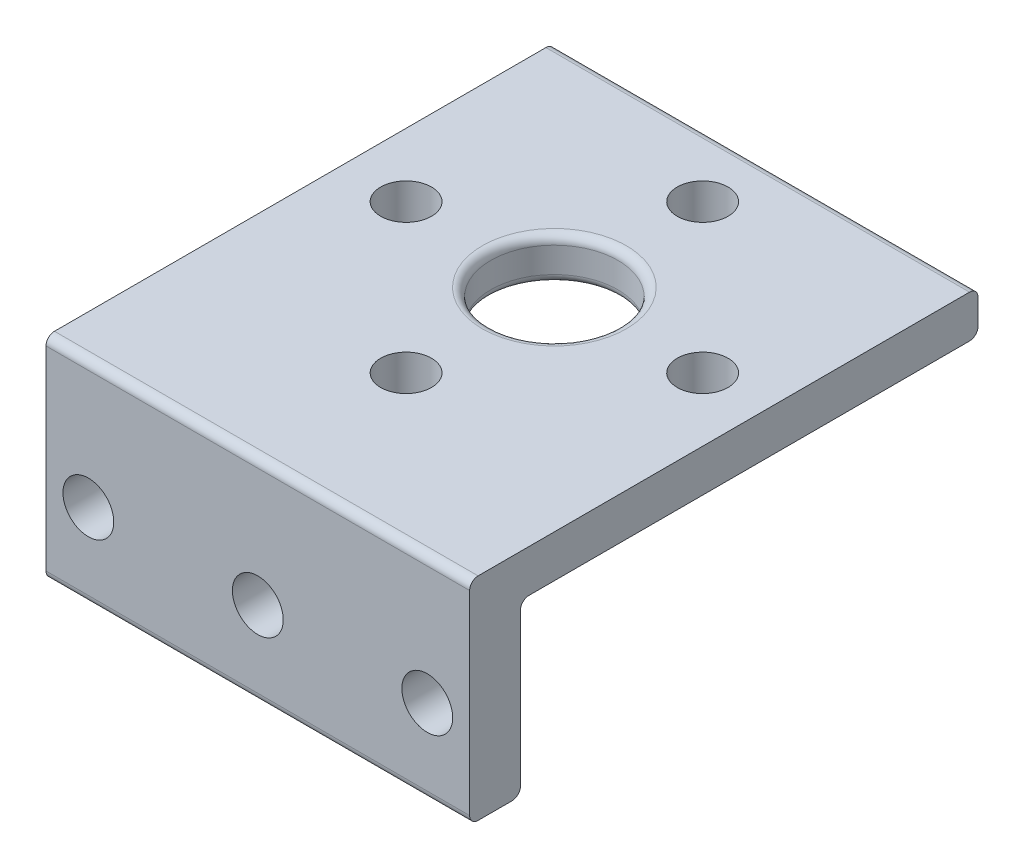
ISO-10303-21;
HEADER;
FILE_DESCRIPTION(('STEP AP214'),'2;1');
FILE_NAME('part.step','',(''),(''),'','','');
FILE_SCHEMA(('AUTOMOTIVE_DESIGN { 1 0 10303 214 1 1 1 1 }'));
ENDSEC;
DATA;
#1=APPLICATION_CONTEXT('core data for automotive mechanical design processes');
#2=APPLICATION_PROTOCOL_DEFINITION('international standard','automotive_design',2000,#1);
#3=PRODUCT_CONTEXT('',#1,'mechanical');
#4=PRODUCT('Part','Part','',(#3));
#5=PRODUCT_RELATED_PRODUCT_CATEGORY('part','',(#4));
#6=PRODUCT_DEFINITION_FORMATION('','',#4);
#7=PRODUCT_DEFINITION_CONTEXT('part definition',#1,'design');
#8=PRODUCT_DEFINITION('design','',#6,#7);
#9=PRODUCT_DEFINITION_SHAPE('','',#8);
#10=(LENGTH_UNIT() NAMED_UNIT(*) SI_UNIT(.MILLI.,.METRE.));
#11=(NAMED_UNIT(*) PLANE_ANGLE_UNIT() SI_UNIT($,.RADIAN.));
#12=(NAMED_UNIT(*) SI_UNIT($,.STERADIAN.) SOLID_ANGLE_UNIT());
#13=UNCERTAINTY_MEASURE_WITH_UNIT(LENGTH_MEASURE(1.E-05),#10,'distance_accuracy_value','');
#14=(GEOMETRIC_REPRESENTATION_CONTEXT(3) GLOBAL_UNCERTAINTY_ASSIGNED_CONTEXT((#13)) GLOBAL_UNIT_ASSIGNED_CONTEXT((#10,
#11,#12)) REPRESENTATION_CONTEXT('',''));
#15=CARTESIAN_POINT('',(0.,0.,0.));
#16=DIRECTION('',(0.,0.,1.));
#17=DIRECTION('',(1.,0.,0.));
#18=AXIS2_PLACEMENT_3D('',#15,#16,#17);
#19=CARTESIAN_POINT('',(0.,0.,0.));
#20=DIRECTION('',(0.,1.,0.));
#21=DIRECTION('',(0.,0.,1.));
#22=AXIS2_PLACEMENT_3D('',#19,#20,#21);
#23=PLANE('',#22);
#24=CARTESIAN_POINT('',(0.,0.,0.));
#25=DIRECTION('',(0.,1.,0.));
#26=DIRECTION('',(0.,0.,1.));
#27=AXIS2_PLACEMENT_3D('',#24,#25,#26);
#28=CIRCLE('',#27,8.5);
#29=CARTESIAN_POINT('',(0.,0.,8.5));
#30=VERTEX_POINT('',#29);
#31=EDGE_CURVE('E175',#30,#30,#28,.T.);
#32=ORIENTED_EDGE('',*,*,#31,.T.);
#33=EDGE_LOOP('',(#32));
#34=FACE_BOUND('',#33,.T.);
#35=CARTESIAN_POINT('',(-17.4999999999996,0.,3.95796859587284E-13));
#36=DIRECTION('',(0.,1.,0.));
#37=DIRECTION('',(0.,0.,1.));
#38=AXIS2_PLACEMENT_3D('',#35,#36,#37);
#39=CIRCLE('',#38,2.99999999999999);
#40=CARTESIAN_POINT('',(-17.4999999999996,0.,3.00000000000039));
#41=VERTEX_POINT('',#40);
#42=EDGE_CURVE('E241',#41,#41,#39,.T.);
#43=ORIENTED_EDGE('',*,*,#42,.T.);
#44=EDGE_LOOP('',(#43));
#45=FACE_BOUND('',#44,.T.);
#46=CARTESIAN_POINT('',(7.87307455377552E-13,0.,17.5));
#47=DIRECTION('',(0.,1.,0.));
#48=DIRECTION('',(0.,0.,1.));
#49=AXIS2_PLACEMENT_3D('',#46,#47,#48);
#50=CIRCLE('',#49,3.);
#51=CARTESIAN_POINT('',(7.87307455377552E-13,0.,20.5));
#52=VERTEX_POINT('',#51);
#53=EDGE_CURVE('E245',#52,#52,#50,.T.);
#54=ORIENTED_EDGE('',*,*,#53,.T.);
#55=EDGE_LOOP('',(#54));
#56=FACE_BOUND('',#55,.T.);
#57=CARTESIAN_POINT('',(17.5000000000004,0.,-3.93653727688776E-13));
#58=DIRECTION('',(0.,1.,0.));
#59=DIRECTION('',(0.,0.,1.));
#60=AXIS2_PLACEMENT_3D('',#57,#58,#59);
#61=CIRCLE('',#60,2.99999999999999);
#62=CARTESIAN_POINT('',(17.5000000000004,0.,2.9999999999996));
#63=VERTEX_POINT('',#62);
#64=EDGE_CURVE('E251',#63,#63,#61,.T.);
#65=ORIENTED_EDGE('',*,*,#64,.T.);
#66=EDGE_LOOP('',(#65));
#67=FACE_BOUND('',#66,.T.);
#68=CARTESIAN_POINT('',(0.,0.,-17.5));
#69=DIRECTION('',(0.,1.,0.));
#70=DIRECTION('',(0.,0.,1.));
#71=AXIS2_PLACEMENT_3D('',#68,#69,#70);
#72=CIRCLE('',#71,3.);
#73=CARTESIAN_POINT('',(0.,0.,-14.5));
#74=VERTEX_POINT('',#73);
#75=EDGE_CURVE('E257',#74,#74,#72,.T.);
#76=ORIENTED_EDGE('',*,*,#75,.T.);
#77=EDGE_LOOP('',(#76));
#78=FACE_BOUND('',#77,.T.);
#79=DIRECTION('',(0.,0.,1.));
#80=VECTOR('',#79,1.);
#81=CARTESIAN_POINT('',(-25.,0.,-25.));
#82=LINE('',#81,#80);
#83=CARTESIAN_POINT('',(-25.,0.,-24.));
#84=VERTEX_POINT('',#83);
#85=CARTESIAN_POINT('',(-25.,0.,28.));
#86=VERTEX_POINT('',#85);
#87=EDGE_CURVE('E142',#84,#86,#82,.T.);
#88=ORIENTED_EDGE('',*,*,#87,.F.);
#89=DIRECTION('',(-1.,0.,0.));
#90=VECTOR('',#89,1.);
#91=CARTESIAN_POINT('',(0.,0.,-24.));
#92=LINE('',#91,#90);
#93=CARTESIAN_POINT('',(25.,0.,-24.));
#94=VERTEX_POINT('',#93);
#95=EDGE_CURVE('E47',#84,#94,#92,.F.);
#96=ORIENTED_EDGE('',*,*,#95,.T.);
#97=DIRECTION('',(0.,0.,-1.));
#98=VECTOR('',#97,1.);
#99=CARTESIAN_POINT('',(25.,0.,-25.));
#100=LINE('',#99,#98);
#101=CARTESIAN_POINT('',(25.,0.,28.));
#102=VERTEX_POINT('',#101);
#103=EDGE_CURVE('E263',#102,#94,#100,.T.);
#104=ORIENTED_EDGE('',*,*,#103,.F.);
#105=DIRECTION('',(1.,0.,0.));
#106=VECTOR('',#105,1.);
#107=CARTESIAN_POINT('',(-25.,0.,28.));
#108=LINE('',#107,#106);
#109=EDGE_CURVE('E172',#102,#86,#108,.F.);
#110=ORIENTED_EDGE('',*,*,#109,.T.);
#111=EDGE_LOOP('',(#88,#96,#104,#110));
#112=FACE_BOUND('',#111,.T.);
#113=ADVANCED_FACE('F32',(#34,#45,#56,#67,#78,#112),#23,.F.);
#114=CARTESIAN_POINT('',(0.,5.,0.));
#115=DIRECTION('',(0.,1.,0.));
#116=DIRECTION('',(0.,0.,1.));
#117=AXIS2_PLACEMENT_3D('',#114,#115,#116);
#118=PLANE('',#117);
#119=CARTESIAN_POINT('',(0.,5.,0.));
#120=DIRECTION('',(0.,1.,0.));
#121=DIRECTION('',(0.,0.,1.));
#122=AXIS2_PLACEMENT_3D('',#119,#120,#121);
#123=CIRCLE('',#122,8.5);
#124=CARTESIAN_POINT('',(0.,5.,8.5));
#125=VERTEX_POINT('',#124);
#126=EDGE_CURVE('E132',#125,#125,#123,.F.);
#127=ORIENTED_EDGE('',*,*,#126,.T.);
#128=EDGE_LOOP('',(#127));
#129=FACE_BOUND('',#128,.T.);
#130=CARTESIAN_POINT('',(7.87307455377552E-13,5.,17.5));
#131=DIRECTION('',(0.,1.,0.));
#132=DIRECTION('',(0.,0.,1.));
#133=AXIS2_PLACEMENT_3D('',#130,#131,#132);
#134=CIRCLE('',#133,3.);
#135=CARTESIAN_POINT('',(7.87307455377552E-13,5.,20.5));
#136=VERTEX_POINT('',#135);
#137=EDGE_CURVE('E248',#136,#136,#134,.T.);
#138=ORIENTED_EDGE('',*,*,#137,.F.);
#139=EDGE_LOOP('',(#138));
#140=FACE_BOUND('',#139,.T.);
#141=CARTESIAN_POINT('',(0.,5.,-17.5));
#142=DIRECTION('',(0.,1.,0.));
#143=DIRECTION('',(0.,0.,1.));
#144=AXIS2_PLACEMENT_3D('',#141,#142,#143);
#145=CIRCLE('',#144,3.);
#146=CARTESIAN_POINT('',(0.,5.,-14.5));
#147=VERTEX_POINT('',#146);
#148=EDGE_CURVE('E260',#147,#147,#145,.T.);
#149=ORIENTED_EDGE('',*,*,#148,.F.);
#150=EDGE_LOOP('',(#149));
#151=FACE_BOUND('',#150,.T.);
#152=DIRECTION('',(0.,0.,-1.));
#153=VECTOR('',#152,1.);
#154=CARTESIAN_POINT('',(25.,5.,-25.));
#155=LINE('',#154,#153);
#156=CARTESIAN_POINT('',(25.,5.,34.));
#157=VERTEX_POINT('',#156);
#158=CARTESIAN_POINT('',(25.,5.,-24.));
#159=VERTEX_POINT('',#158);
#160=EDGE_CURVE('E126',#157,#159,#155,.T.);
#161=ORIENTED_EDGE('',*,*,#160,.T.);
#162=DIRECTION('',(-1.,0.,0.));
#163=VECTOR('',#162,1.);
#164=CARTESIAN_POINT('',(-25.,5.,-24.));
#165=LINE('',#164,#163);
#166=CARTESIAN_POINT('',(-25.,5.,-24.));
#167=VERTEX_POINT('',#166);
#168=EDGE_CURVE('E205',#159,#167,#165,.T.);
#169=ORIENTED_EDGE('',*,*,#168,.T.);
#170=DIRECTION('',(0.,0.,1.));
#171=VECTOR('',#170,1.);
#172=CARTESIAN_POINT('',(-25.,5.,-25.));
#173=LINE('',#172,#171);
#174=CARTESIAN_POINT('',(-25.,5.,34.));
#175=VERTEX_POINT('',#174);
#176=EDGE_CURVE('E129',#167,#175,#173,.T.);
#177=ORIENTED_EDGE('',*,*,#176,.T.);
#178=DIRECTION('',(-1.,0.,0.));
#179=VECTOR('',#178,1.);
#180=CARTESIAN_POINT('',(0.,5.,34.));
#181=LINE('',#180,#179);
#182=EDGE_CURVE('E121',#175,#157,#181,.F.);
#183=ORIENTED_EDGE('',*,*,#182,.T.);
#184=EDGE_LOOP('',(#161,#169,#177,#183));
#185=FACE_BOUND('',#184,.T.);
#186=CARTESIAN_POINT('',(17.5000000000004,5.,-3.93653727688776E-13));
#187=DIRECTION('',(0.,1.,0.));
#188=DIRECTION('',(0.,0.,1.));
#189=AXIS2_PLACEMENT_3D('',#186,#187,#188);
#190=CIRCLE('',#189,2.99999999999999);
#191=CARTESIAN_POINT('',(17.5000000000004,5.,2.9999999999996));
#192=VERTEX_POINT('',#191);
#193=EDGE_CURVE('E254',#192,#192,#190,.T.);
#194=ORIENTED_EDGE('',*,*,#193,.F.);
#195=EDGE_LOOP('',(#194));
#196=FACE_BOUND('',#195,.T.);
#197=CARTESIAN_POINT('',(-17.4999999999996,5.,3.95796859587284E-13));
#198=DIRECTION('',(0.,1.,0.));
#199=DIRECTION('',(0.,0.,1.));
#200=AXIS2_PLACEMENT_3D('',#197,#198,#199);
#201=CIRCLE('',#200,2.99999999999999);
#202=CARTESIAN_POINT('',(-17.4999999999996,5.,3.00000000000039));
#203=VERTEX_POINT('',#202);
#204=EDGE_CURVE('E242',#203,#203,#201,.T.);
#205=ORIENTED_EDGE('',*,*,#204,.F.);
#206=EDGE_LOOP('',(#205));
#207=FACE_BOUND('',#206,.T.);
#208=ADVANCED_FACE('F123',(#129,#140,#151,#185,#196,#207),#118,.T.);
#209=CARTESIAN_POINT('',(25.,5.,-25.));
#210=DIRECTION('',(-1.,0.,0.));
#211=DIRECTION('',(0.,0.,1.));
#212=AXIS2_PLACEMENT_3D('',#209,#210,#211);
#213=PLANE('',#212);
#214=DIRECTION('',(0.,-1.,0.));
#215=VECTOR('',#214,1.);
#216=CARTESIAN_POINT('',(25.,5.,-25.));
#217=LINE('',#216,#215);
#218=CARTESIAN_POINT('',(25.,4.,-25.));
#219=VERTEX_POINT('',#218);
#220=CARTESIAN_POINT('',(25.,1.,-25.));
#221=VERTEX_POINT('',#220);
#222=EDGE_CURVE('E133',#219,#221,#217,.T.);
#223=ORIENTED_EDGE('',*,*,#222,.F.);
#224=CARTESIAN_POINT('',(25.,4.,-24.));
#225=DIRECTION('',(-1.,0.,0.));
#226=DIRECTION('',(0.,0.,1.));
#227=AXIS2_PLACEMENT_3D('',#224,#225,#226);
#228=CIRCLE('',#227,1.);
#229=EDGE_CURVE('E141',#219,#159,#228,.F.);
#230=ORIENTED_EDGE('',*,*,#229,.T.);
#231=ORIENTED_EDGE('',*,*,#160,.F.);
#232=CARTESIAN_POINT('',(25.,4.,34.));
#233=DIRECTION('',(-1.,0.,0.));
#234=DIRECTION('',(0.,0.,1.));
#235=AXIS2_PLACEMENT_3D('',#232,#233,#234);
#236=CIRCLE('',#235,1.);
#237=CARTESIAN_POINT('',(25.,4.,35.));
#238=VERTEX_POINT('',#237);
#239=EDGE_CURVE('E138',#157,#238,#236,.F.);
#240=ORIENTED_EDGE('',*,*,#239,.T.);
#241=DIRECTION('',(0.,1.,0.));
#242=VECTOR('',#241,1.);
#243=CARTESIAN_POINT('',(25.,0.,35.));
#244=LINE('',#243,#242);
#245=CARTESIAN_POINT('',(25.,-19.,35.));
#246=VERTEX_POINT('',#245);
#247=EDGE_CURVE('E239',#246,#238,#244,.T.);
#248=ORIENTED_EDGE('',*,*,#247,.F.);
#249=CARTESIAN_POINT('',(25.,-19.,34.));
#250=DIRECTION('',(-1.,0.,0.));
#251=DIRECTION('',(0.,0.,1.));
#252=AXIS2_PLACEMENT_3D('',#249,#250,#251);
#253=CIRCLE('',#252,1.);
#254=CARTESIAN_POINT('',(25.,-20.,34.));
#255=VERTEX_POINT('',#254);
#256=EDGE_CURVE('E148',#246,#255,#253,.F.);
#257=ORIENTED_EDGE('',*,*,#256,.T.);
#258=DIRECTION('',(0.,0.,1.));
#259=VECTOR('',#258,1.);
#260=CARTESIAN_POINT('',(25.,-20.,35.));
#261=LINE('',#260,#259);
#262=CARTESIAN_POINT('',(25.,-20.,30.));
#263=VERTEX_POINT('',#262);
#264=EDGE_CURVE('E223',#263,#255,#261,.T.);
#265=ORIENTED_EDGE('',*,*,#264,.F.);
#266=CARTESIAN_POINT('',(25.,-19.,30.));
#267=DIRECTION('',(-1.,0.,0.));
#268=DIRECTION('',(0.,0.,1.));
#269=AXIS2_PLACEMENT_3D('',#266,#267,#268);
#270=CIRCLE('',#269,1.);
#271=CARTESIAN_POINT('',(25.,-19.,29.));
#272=VERTEX_POINT('',#271);
#273=EDGE_CURVE('E152',#263,#272,#270,.F.);
#274=ORIENTED_EDGE('',*,*,#273,.T.);
#275=DIRECTION('',(0.,1.,0.));
#276=VECTOR('',#275,1.);
#277=CARTESIAN_POINT('',(25.,-20.,29.));
#278=LINE('',#277,#276);
#279=CARTESIAN_POINT('',(25.,-1.,29.));
#280=VERTEX_POINT('',#279);
#281=EDGE_CURVE('E190',#272,#280,#278,.T.);
#282=ORIENTED_EDGE('',*,*,#281,.T.);
#283=CARTESIAN_POINT('',(25.,-1.,28.));
#284=DIRECTION('',(-1.,0.,0.));
#285=DIRECTION('',(0.,0.,1.));
#286=AXIS2_PLACEMENT_3D('',#283,#284,#285);
#287=CIRCLE('',#286,1.);
#288=EDGE_CURVE('E40',#280,#102,#287,.T.);
#289=ORIENTED_EDGE('',*,*,#288,.T.);
#290=ORIENTED_EDGE('',*,*,#103,.T.);
#291=CARTESIAN_POINT('',(25.,1.,-24.));
#292=DIRECTION('',(-1.,0.,0.));
#293=DIRECTION('',(0.,0.,1.));
#294=AXIS2_PLACEMENT_3D('',#291,#292,#293);
#295=CIRCLE('',#294,1.);
#296=EDGE_CURVE('E149',#94,#221,#295,.F.);
#297=ORIENTED_EDGE('',*,*,#296,.T.);
#298=EDGE_LOOP('',(#223,#230,#231,#240,#248,#257,#265,#274,#282,#289,#290,#297));
#299=FACE_BOUND('',#298,.T.);
#300=ADVANCED_FACE('F136',(#299),#213,.F.);
#301=CARTESIAN_POINT('',(-25.,5.,-25.));
#302=DIRECTION('',(0.,0.,1.));
#303=DIRECTION('',(1.,0.,0.));
#304=AXIS2_PLACEMENT_3D('',#301,#302,#303);
#305=PLANE('',#304);
#306=DIRECTION('',(0.,-1.,0.));
#307=VECTOR('',#306,1.);
#308=CARTESIAN_POINT('',(-25.,5.,-25.));
#309=LINE('',#308,#307);
#310=CARTESIAN_POINT('',(-25.,4.,-25.));
#311=VERTEX_POINT('',#310);
#312=CARTESIAN_POINT('',(-25.,1.,-25.));
#313=VERTEX_POINT('',#312);
#314=EDGE_CURVE('E267',#311,#313,#309,.T.);
#315=ORIENTED_EDGE('',*,*,#314,.F.);
#316=DIRECTION('',(-1.,0.,0.));
#317=VECTOR('',#316,1.);
#318=CARTESIAN_POINT('',(25.,4.,-25.));
#319=LINE('',#318,#317);
#320=EDGE_CURVE('E220',#311,#219,#319,.F.);
#321=ORIENTED_EDGE('',*,*,#320,.T.);
#322=ORIENTED_EDGE('',*,*,#222,.T.);
#323=DIRECTION('',(-1.,0.,0.));
#324=VECTOR('',#323,1.);
#325=CARTESIAN_POINT('',(-25.,1.,-25.));
#326=LINE('',#325,#324);
#327=EDGE_CURVE('E217',#221,#313,#326,.T.);
#328=ORIENTED_EDGE('',*,*,#327,.T.);
#329=EDGE_LOOP('',(#315,#321,#322,#328));
#330=FACE_BOUND('',#329,.T.);
#331=ADVANCED_FACE('F315',(#330),#305,.F.);
#332=CARTESIAN_POINT('',(-25.,5.,-25.));
#333=DIRECTION('',(1.,0.,0.));
#334=DIRECTION('',(0.,0.,-1.));
#335=AXIS2_PLACEMENT_3D('',#332,#333,#334);
#336=PLANE('',#335);
#337=ORIENTED_EDGE('',*,*,#176,.F.);
#338=CARTESIAN_POINT('',(-25.,4.,-24.));
#339=DIRECTION('',(1.,0.,0.));
#340=DIRECTION('',(0.,0.,-1.));
#341=AXIS2_PLACEMENT_3D('',#338,#339,#340);
#342=CIRCLE('',#341,1.);
#343=EDGE_CURVE('E215',#167,#311,#342,.F.);
#344=ORIENTED_EDGE('',*,*,#343,.T.);
#345=ORIENTED_EDGE('',*,*,#314,.T.);
#346=CARTESIAN_POINT('',(-25.,1.,-24.));
#347=DIRECTION('',(1.,0.,0.));
#348=DIRECTION('',(0.,0.,-1.));
#349=AXIS2_PLACEMENT_3D('',#346,#347,#348);
#350=CIRCLE('',#349,1.);
#351=EDGE_CURVE('E204',#313,#84,#350,.F.);
#352=ORIENTED_EDGE('',*,*,#351,.T.);
#353=ORIENTED_EDGE('',*,*,#87,.T.);
#354=CARTESIAN_POINT('',(-25.,-1.,28.));
#355=DIRECTION('',(1.,0.,0.));
#356=DIRECTION('',(0.,0.,-1.));
#357=AXIS2_PLACEMENT_3D('',#354,#355,#356);
#358=CIRCLE('',#357,1.);
#359=CARTESIAN_POINT('',(-25.,-1.,29.));
#360=VERTEX_POINT('',#359);
#361=EDGE_CURVE('E11',#86,#360,#358,.T.);
#362=ORIENTED_EDGE('',*,*,#361,.T.);
#363=DIRECTION('',(0.,1.,0.));
#364=VECTOR('',#363,1.);
#365=CARTESIAN_POINT('',(-25.,-20.,29.));
#366=LINE('',#365,#364);
#367=CARTESIAN_POINT('',(-25.,-19.,29.));
#368=VERTEX_POINT('',#367);
#369=EDGE_CURVE('E188',#368,#360,#366,.T.);
#370=ORIENTED_EDGE('',*,*,#369,.F.);
#371=CARTESIAN_POINT('',(-25.,-19.,30.));
#372=DIRECTION('',(1.,0.,0.));
#373=DIRECTION('',(0.,0.,-1.));
#374=AXIS2_PLACEMENT_3D('',#371,#372,#373);
#375=CIRCLE('',#374,1.);
#376=CARTESIAN_POINT('',(-25.,-20.,30.));
#377=VERTEX_POINT('',#376);
#378=EDGE_CURVE('E196',#368,#377,#375,.F.);
#379=ORIENTED_EDGE('',*,*,#378,.T.);
#380=DIRECTION('',(0.,0.,-1.));
#381=VECTOR('',#380,1.);
#382=CARTESIAN_POINT('',(-25.,-20.,29.));
#383=LINE('',#382,#381);
#384=CARTESIAN_POINT('',(-25.,-20.,34.));
#385=VERTEX_POINT('',#384);
#386=EDGE_CURVE('E227',#385,#377,#383,.T.);
#387=ORIENTED_EDGE('',*,*,#386,.F.);
#388=CARTESIAN_POINT('',(-25.,-19.,34.));
#389=DIRECTION('',(1.,0.,0.));
#390=DIRECTION('',(0.,0.,-1.));
#391=AXIS2_PLACEMENT_3D('',#388,#389,#390);
#392=CIRCLE('',#391,1.);
#393=CARTESIAN_POINT('',(-25.,-19.,35.));
#394=VERTEX_POINT('',#393);
#395=EDGE_CURVE('E213',#385,#394,#392,.F.);
#396=ORIENTED_EDGE('',*,*,#395,.T.);
#397=DIRECTION('',(0.,-1.,0.));
#398=VECTOR('',#397,1.);
#399=CARTESIAN_POINT('',(-25.,5.,35.));
#400=LINE('',#399,#398);
#401=CARTESIAN_POINT('',(-25.,4.,35.));
#402=VERTEX_POINT('',#401);
#403=EDGE_CURVE('E200',#402,#394,#400,.T.);
#404=ORIENTED_EDGE('',*,*,#403,.F.);
#405=CARTESIAN_POINT('',(-25.,4.,34.));
#406=DIRECTION('',(1.,0.,0.));
#407=DIRECTION('',(0.,0.,-1.));
#408=AXIS2_PLACEMENT_3D('',#405,#406,#407);
#409=CIRCLE('',#408,1.);
#410=EDGE_CURVE('E207',#402,#175,#409,.F.);
#411=ORIENTED_EDGE('',*,*,#410,.T.);
#412=EDGE_LOOP('',(#337,#344,#345,#352,#353,#362,#370,#379,#387,#396,#404,#411));
#413=FACE_BOUND('',#412,.T.);
#414=ADVANCED_FACE('F194',(#413),#336,.F.);
#415=CARTESIAN_POINT('',(0.,5.,0.));
#416=DIRECTION('',(0.,-1.,0.));
#417=DIRECTION('',(0.,0.,-1.));
#418=AXIS2_PLACEMENT_3D('',#415,#416,#417);
#419=CYLINDRICAL_SURFACE('',#418,7.5);
#420=CARTESIAN_POINT('',(0.,4.,0.));
#421=DIRECTION('',(0.,1.,0.));
#422=DIRECTION('',(0.,0.,1.));
#423=AXIS2_PLACEMENT_3D('',#420,#421,#422);
#424=CIRCLE('',#423,7.5);
#425=CARTESIAN_POINT('',(0.,4.,7.5));
#426=VERTEX_POINT('',#425);
#427=EDGE_CURVE('E169',#426,#426,#424,.T.);
#428=ORIENTED_EDGE('',*,*,#427,.T.);
#429=EDGE_LOOP('',(#428));
#430=FACE_BOUND('',#429,.T.);
#431=CARTESIAN_POINT('',(0.,1.,0.));
#432=DIRECTION('',(0.,1.,0.));
#433=DIRECTION('',(0.,0.,1.));
#434=AXIS2_PLACEMENT_3D('',#431,#432,#433);
#435=CIRCLE('',#434,7.5);
#436=CARTESIAN_POINT('',(0.,1.,7.5));
#437=VERTEX_POINT('',#436);
#438=EDGE_CURVE('E166',#437,#437,#435,.F.);
#439=ORIENTED_EDGE('',*,*,#438,.T.);
#440=EDGE_LOOP('',(#439));
#441=FACE_BOUND('',#440,.T.);
#442=ADVANCED_FACE('F286',(#430,#441),#419,.F.);
#443=CARTESIAN_POINT('',(0.,5.,-17.5));
#444=DIRECTION('',(0.,-1.,0.));
#445=DIRECTION('',(0.,0.,-1.));
#446=AXIS2_PLACEMENT_3D('',#443,#444,#445);
#447=CYLINDRICAL_SURFACE('',#446,3.);
#448=ORIENTED_EDGE('',*,*,#148,.T.);
#449=EDGE_LOOP('',(#448));
#450=FACE_BOUND('',#449,.T.);
#451=ORIENTED_EDGE('',*,*,#75,.F.);
#452=EDGE_LOOP('',(#451));
#453=FACE_BOUND('',#452,.T.);
#454=ADVANCED_FACE('F289',(#450,#453),#447,.F.);
#455=CARTESIAN_POINT('',(17.5000000000004,5.,-3.93653727688776E-13));
#456=DIRECTION('',(0.,-1.,0.));
#457=DIRECTION('',(0.,0.,-1.));
#458=AXIS2_PLACEMENT_3D('',#455,#456,#457);
#459=CYLINDRICAL_SURFACE('',#458,2.99999999999999);
#460=ORIENTED_EDGE('',*,*,#193,.T.);
#461=EDGE_LOOP('',(#460));
#462=FACE_BOUND('',#461,.T.);
#463=ORIENTED_EDGE('',*,*,#64,.F.);
#464=EDGE_LOOP('',(#463));
#465=FACE_BOUND('',#464,.T.);
#466=ADVANCED_FACE('F509',(#462,#465),#459,.F.);
#467=CARTESIAN_POINT('',(7.87307455377552E-13,5.,17.5));
#468=DIRECTION('',(0.,-1.,0.));
#469=DIRECTION('',(0.,0.,-1.));
#470=AXIS2_PLACEMENT_3D('',#467,#468,#469);
#471=CYLINDRICAL_SURFACE('',#470,3.);
#472=ORIENTED_EDGE('',*,*,#137,.T.);
#473=EDGE_LOOP('',(#472));
#474=FACE_BOUND('',#473,.T.);
#475=ORIENTED_EDGE('',*,*,#53,.F.);
#476=EDGE_LOOP('',(#475));
#477=FACE_BOUND('',#476,.T.);
#478=ADVANCED_FACE('F499',(#474,#477),#471,.F.);
#479=CARTESIAN_POINT('',(-17.4999999999996,5.,3.95796859587284E-13));
#480=DIRECTION('',(0.,-1.,0.));
#481=DIRECTION('',(0.,0.,-1.));
#482=AXIS2_PLACEMENT_3D('',#479,#480,#481);
#483=CYLINDRICAL_SURFACE('',#482,2.99999999999999);
#484=ORIENTED_EDGE('',*,*,#204,.T.);
#485=EDGE_LOOP('',(#484));
#486=FACE_BOUND('',#485,.T.);
#487=ORIENTED_EDGE('',*,*,#42,.F.);
#488=EDGE_LOOP('',(#487));
#489=FACE_BOUND('',#488,.T.);
#490=ADVANCED_FACE('F413',(#486,#489),#483,.F.);
#491=CARTESIAN_POINT('',(0.,0.,35.));
#492=DIRECTION('',(0.,0.,1.));
#493=DIRECTION('',(1.,0.,0.));
#494=AXIS2_PLACEMENT_3D('',#491,#492,#493);
#495=PLANE('',#494);
#496=CARTESIAN_POINT('',(20.,-10.,35.));
#497=DIRECTION('',(0.,0.,-1.));
#498=DIRECTION('',(-1.,0.,0.));
#499=AXIS2_PLACEMENT_3D('',#496,#497,#498);
#500=CIRCLE('',#499,2.99999999999999);
#501=CARTESIAN_POINT('',(17.,-10.,35.));
#502=VERTEX_POINT('',#501);
#503=EDGE_CURVE('E552',#502,#502,#500,.T.);
#504=ORIENTED_EDGE('',*,*,#503,.T.);
#505=EDGE_LOOP('',(#504));
#506=FACE_BOUND('',#505,.T.);
#507=CARTESIAN_POINT('',(-20.,-10.,35.));
#508=DIRECTION('',(0.,0.,-1.));
#509=DIRECTION('',(-1.,0.,0.));
#510=AXIS2_PLACEMENT_3D('',#507,#508,#509);
#511=CIRCLE('',#510,2.99999999999999);
#512=CARTESIAN_POINT('',(-23.,-10.,35.));
#513=VERTEX_POINT('',#512);
#514=EDGE_CURVE('E545',#513,#513,#511,.T.);
#515=ORIENTED_EDGE('',*,*,#514,.T.);
#516=EDGE_LOOP('',(#515));
#517=FACE_BOUND('',#516,.T.);
#518=CARTESIAN_POINT('',(0.,-10.,35.));
#519=DIRECTION('',(0.,0.,-1.));
#520=DIRECTION('',(-1.,0.,0.));
#521=AXIS2_PLACEMENT_3D('',#518,#519,#520);
#522=CIRCLE('',#521,3.);
#523=CARTESIAN_POINT('',(-3.,-10.,35.));
#524=VERTEX_POINT('',#523);
#525=EDGE_CURVE('E228',#524,#524,#522,.T.);
#526=ORIENTED_EDGE('',*,*,#525,.T.);
#527=EDGE_LOOP('',(#526));
#528=FACE_BOUND('',#527,.T.);
#529=ORIENTED_EDGE('',*,*,#403,.T.);
#530=DIRECTION('',(-1.,0.,0.));
#531=VECTOR('',#530,1.);
#532=CARTESIAN_POINT('',(25.,-19.,35.));
#533=LINE('',#532,#531);
#534=EDGE_CURVE('E164',#394,#246,#533,.F.);
#535=ORIENTED_EDGE('',*,*,#534,.T.);
#536=ORIENTED_EDGE('',*,*,#247,.T.);
#537=DIRECTION('',(-1.,0.,0.));
#538=VECTOR('',#537,1.);
#539=CARTESIAN_POINT('',(0.,4.,35.));
#540=LINE('',#539,#538);
#541=EDGE_CURVE('E147',#238,#402,#540,.T.);
#542=ORIENTED_EDGE('',*,*,#541,.T.);
#543=EDGE_LOOP('',(#529,#535,#536,#542));
#544=FACE_BOUND('',#543,.T.);
#545=ADVANCED_FACE('F321',(#506,#517,#528,#544),#495,.T.);
#546=CARTESIAN_POINT('',(25.,-20.,29.));
#547=DIRECTION('',(0.,0.,1.));
#548=DIRECTION('',(1.,0.,0.));
#549=AXIS2_PLACEMENT_3D('',#546,#547,#548);
#550=PLANE('',#549);
#551=CARTESIAN_POINT('',(20.,-10.,29.));
#552=DIRECTION('',(0.,0.,-1.));
#553=DIRECTION('',(-1.,0.,0.));
#554=AXIS2_PLACEMENT_3D('',#551,#552,#553);
#555=CIRCLE('',#554,2.99999999999999);
#556=CARTESIAN_POINT('',(17.,-10.,29.));
#557=VERTEX_POINT('',#556);
#558=EDGE_CURVE('E557',#557,#557,#555,.T.);
#559=ORIENTED_EDGE('',*,*,#558,.F.);
#560=EDGE_LOOP('',(#559));
#561=FACE_BOUND('',#560,.T.);
#562=CARTESIAN_POINT('',(-20.,-10.,29.));
#563=DIRECTION('',(0.,0.,-1.));
#564=DIRECTION('',(-1.,0.,0.));
#565=AXIS2_PLACEMENT_3D('',#562,#563,#564);
#566=CIRCLE('',#565,2.99999999999999);
#567=CARTESIAN_POINT('',(-23.,-10.,29.));
#568=VERTEX_POINT('',#567);
#569=EDGE_CURVE('E547',#568,#568,#566,.T.);
#570=ORIENTED_EDGE('',*,*,#569,.F.);
#571=EDGE_LOOP('',(#570));
#572=FACE_BOUND('',#571,.T.);
#573=CARTESIAN_POINT('',(0.,-10.,29.));
#574=DIRECTION('',(0.,0.,-1.));
#575=DIRECTION('',(-1.,0.,0.));
#576=AXIS2_PLACEMENT_3D('',#573,#574,#575);
#577=CIRCLE('',#576,3.);
#578=CARTESIAN_POINT('',(-3.,-10.,29.));
#579=VERTEX_POINT('',#578);
#580=EDGE_CURVE('E232',#579,#579,#577,.T.);
#581=ORIENTED_EDGE('',*,*,#580,.F.);
#582=EDGE_LOOP('',(#581));
#583=FACE_BOUND('',#582,.T.);
#584=ORIENTED_EDGE('',*,*,#281,.F.);
#585=DIRECTION('',(1.,0.,0.));
#586=VECTOR('',#585,1.);
#587=CARTESIAN_POINT('',(25.,-19.,29.));
#588=LINE('',#587,#586);
#589=EDGE_CURVE('E181',#272,#368,#588,.F.);
#590=ORIENTED_EDGE('',*,*,#589,.T.);
#591=ORIENTED_EDGE('',*,*,#369,.T.);
#592=DIRECTION('',(1.,0.,0.));
#593=VECTOR('',#592,1.);
#594=CARTESIAN_POINT('',(25.,-1.,29.));
#595=LINE('',#594,#593);
#596=EDGE_CURVE('E178',#360,#280,#595,.T.);
#597=ORIENTED_EDGE('',*,*,#596,.T.);
#598=EDGE_LOOP('',(#584,#590,#591,#597));
#599=FACE_BOUND('',#598,.T.);
#600=ADVANCED_FACE('F187',(#561,#572,#583,#599),#550,.F.);
#601=CARTESIAN_POINT('',(0.,-20.,0.));
#602=DIRECTION('',(0.,1.,0.));
#603=DIRECTION('',(0.,0.,1.));
#604=AXIS2_PLACEMENT_3D('',#601,#602,#603);
#605=PLANE('',#604);
#606=ORIENTED_EDGE('',*,*,#264,.T.);
#607=DIRECTION('',(-1.,0.,0.));
#608=VECTOR('',#607,1.);
#609=CARTESIAN_POINT('',(-25.,-20.,34.));
#610=LINE('',#609,#608);
#611=EDGE_CURVE('E160',#255,#385,#610,.T.);
#612=ORIENTED_EDGE('',*,*,#611,.T.);
#613=ORIENTED_EDGE('',*,*,#386,.T.);
#614=DIRECTION('',(1.,0.,0.));
#615=VECTOR('',#614,1.);
#616=CARTESIAN_POINT('',(0.,-20.,30.));
#617=LINE('',#616,#615);
#618=EDGE_CURVE('E157',#377,#263,#617,.T.);
#619=ORIENTED_EDGE('',*,*,#618,.T.);
#620=EDGE_LOOP('',(#606,#612,#613,#619));
#621=FACE_BOUND('',#620,.T.);
#622=ADVANCED_FACE('F225',(#621),#605,.F.);
#623=CARTESIAN_POINT('',(0.,-10.,35.));
#624=DIRECTION('',(0.,0.,-1.));
#625=DIRECTION('',(-1.,0.,0.));
#626=AXIS2_PLACEMENT_3D('',#623,#624,#625);
#627=CYLINDRICAL_SURFACE('',#626,3.);
#628=ORIENTED_EDGE('',*,*,#525,.F.);
#629=EDGE_LOOP('',(#628));
#630=FACE_BOUND('',#629,.T.);
#631=ORIENTED_EDGE('',*,*,#580,.T.);
#632=EDGE_LOOP('',(#631));
#633=FACE_BOUND('',#632,.T.);
#634=ADVANCED_FACE('F393',(#630,#633),#627,.F.);
#635=CARTESIAN_POINT('',(-20.,-10.,35.));
#636=DIRECTION('',(0.,0.,-1.));
#637=DIRECTION('',(-1.,0.,0.));
#638=AXIS2_PLACEMENT_3D('',#635,#636,#637);
#639=CYLINDRICAL_SURFACE('',#638,2.99999999999999);
#640=ORIENTED_EDGE('',*,*,#514,.F.);
#641=EDGE_LOOP('',(#640));
#642=FACE_BOUND('',#641,.T.);
#643=ORIENTED_EDGE('',*,*,#569,.T.);
#644=EDGE_LOOP('',(#643));
#645=FACE_BOUND('',#644,.T.);
#646=ADVANCED_FACE('F475',(#642,#645),#639,.F.);
#647=CARTESIAN_POINT('',(20.,-10.,35.));
#648=DIRECTION('',(0.,0.,-1.));
#649=DIRECTION('',(-1.,0.,0.));
#650=AXIS2_PLACEMENT_3D('',#647,#648,#649);
#651=CYLINDRICAL_SURFACE('',#650,2.99999999999999);
#652=ORIENTED_EDGE('',*,*,#503,.F.);
#653=EDGE_LOOP('',(#652));
#654=FACE_BOUND('',#653,.T.);
#655=ORIENTED_EDGE('',*,*,#558,.T.);
#656=EDGE_LOOP('',(#655));
#657=FACE_BOUND('',#656,.T.);
#658=ADVANCED_FACE('F330',(#654,#657),#651,.F.);
#659=CARTESIAN_POINT('',(0.,4.,-24.));
#660=DIRECTION('',(1.,0.,0.));
#661=DIRECTION('',(0.,0.,-1.));
#662=AXIS2_PLACEMENT_3D('',#659,#660,#661);
#663=CYLINDRICAL_SURFACE('',#662,1.);
#664=ORIENTED_EDGE('',*,*,#229,.F.);
#665=ORIENTED_EDGE('',*,*,#320,.F.);
#666=ORIENTED_EDGE('',*,*,#343,.F.);
#667=ORIENTED_EDGE('',*,*,#168,.F.);
#668=EDGE_LOOP('',(#664,#665,#666,#667));
#669=FACE_BOUND('',#668,.T.);
#670=ADVANCED_FACE('F318',(#669),#663,.T.);
#671=CARTESIAN_POINT('',(0.,-19.,34.));
#672=DIRECTION('',(1.,0.,0.));
#673=DIRECTION('',(0.,0.,-1.));
#674=AXIS2_PLACEMENT_3D('',#671,#672,#673);
#675=CYLINDRICAL_SURFACE('',#674,1.);
#676=ORIENTED_EDGE('',*,*,#256,.F.);
#677=ORIENTED_EDGE('',*,*,#534,.F.);
#678=ORIENTED_EDGE('',*,*,#395,.F.);
#679=ORIENTED_EDGE('',*,*,#611,.F.);
#680=EDGE_LOOP('',(#676,#677,#678,#679));
#681=FACE_BOUND('',#680,.T.);
#682=ADVANCED_FACE('F282',(#681),#675,.T.);
#683=CARTESIAN_POINT('',(0.,4.,0.));
#684=DIRECTION('',(0.,1.,0.));
#685=DIRECTION('',(0.,0.,1.));
#686=AXIS2_PLACEMENT_3D('',#683,#684,#685);
#687=TOROIDAL_SURFACE('',#686,8.5,1.);
#688=ORIENTED_EDGE('',*,*,#126,.F.);
#689=EDGE_LOOP('',(#688));
#690=FACE_BOUND('',#689,.T.);
#691=ORIENTED_EDGE('',*,*,#427,.F.);
#692=EDGE_LOOP('',(#691));
#693=FACE_BOUND('',#692,.T.);
#694=ADVANCED_FACE('F278',(#690,#693),#687,.T.);
#695=CARTESIAN_POINT('',(0.,1.,0.));
#696=DIRECTION('',(0.,1.,0.));
#697=DIRECTION('',(0.,0.,1.));
#698=AXIS2_PLACEMENT_3D('',#695,#696,#697);
#699=TOROIDAL_SURFACE('',#698,8.5,1.);
#700=ORIENTED_EDGE('',*,*,#438,.F.);
#701=EDGE_LOOP('',(#700));
#702=FACE_BOUND('',#701,.T.);
#703=ORIENTED_EDGE('',*,*,#31,.F.);
#704=EDGE_LOOP('',(#703));
#705=FACE_BOUND('',#704,.T.);
#706=ADVANCED_FACE('F281',(#702,#705),#699,.T.);
#707=CARTESIAN_POINT('',(0.,4.,34.));
#708=DIRECTION('',(-1.,0.,0.));
#709=DIRECTION('',(0.,0.,1.));
#710=AXIS2_PLACEMENT_3D('',#707,#708,#709);
#711=CYLINDRICAL_SURFACE('',#710,1.);
#712=ORIENTED_EDGE('',*,*,#239,.F.);
#713=ORIENTED_EDGE('',*,*,#182,.F.);
#714=ORIENTED_EDGE('',*,*,#410,.F.);
#715=ORIENTED_EDGE('',*,*,#541,.F.);
#716=EDGE_LOOP('',(#712,#713,#714,#715));
#717=FACE_BOUND('',#716,.T.);
#718=ADVANCED_FACE('F145',(#717),#711,.T.);
#719=CARTESIAN_POINT('',(-25.,1.,-24.));
#720=DIRECTION('',(-1.,0.,0.));
#721=DIRECTION('',(0.,0.,1.));
#722=AXIS2_PLACEMENT_3D('',#719,#720,#721);
#723=CYLINDRICAL_SURFACE('',#722,1.);
#724=ORIENTED_EDGE('',*,*,#296,.F.);
#725=ORIENTED_EDGE('',*,*,#95,.F.);
#726=ORIENTED_EDGE('',*,*,#351,.F.);
#727=ORIENTED_EDGE('',*,*,#327,.F.);
#728=EDGE_LOOP('',(#724,#725,#726,#727));
#729=FACE_BOUND('',#728,.T.);
#730=ADVANCED_FACE('F311',(#729),#723,.T.);
#731=CARTESIAN_POINT('',(0.,-19.,30.));
#732=DIRECTION('',(1.,0.,0.));
#733=DIRECTION('',(0.,0.,-1.));
#734=AXIS2_PLACEMENT_3D('',#731,#732,#733);
#735=CYLINDRICAL_SURFACE('',#734,1.);
#736=ORIENTED_EDGE('',*,*,#378,.F.);
#737=ORIENTED_EDGE('',*,*,#589,.F.);
#738=ORIENTED_EDGE('',*,*,#273,.F.);
#739=ORIENTED_EDGE('',*,*,#618,.F.);
#740=EDGE_LOOP('',(#736,#737,#738,#739));
#741=FACE_BOUND('',#740,.T.);
#742=ADVANCED_FACE('F203',(#741),#735,.T.);
#743=CARTESIAN_POINT('',(25.,-1.,28.));
#744=DIRECTION('',(-1.,0.,0.));
#745=DIRECTION('',(0.,0.,1.));
#746=AXIS2_PLACEMENT_3D('',#743,#744,#745);
#747=CYLINDRICAL_SURFACE('',#746,1.);
#748=ORIENTED_EDGE('',*,*,#361,.F.);
#749=ORIENTED_EDGE('',*,*,#109,.F.);
#750=ORIENTED_EDGE('',*,*,#288,.F.);
#751=ORIENTED_EDGE('',*,*,#596,.F.);
#752=EDGE_LOOP('',(#748,#749,#750,#751));
#753=FACE_BOUND('',#752,.T.);
#754=ADVANCED_FACE('F34',(#753),#747,.F.);
#755=CLOSED_SHELL('',(#113,#208,#300,#331,#414,#442,#454,#466,#478,#490,#545,#600,#622,#634,
#646,#658,#670,#682,#694,#706,#718,#730,#742,#754));
#756=MANIFOLD_SOLID_BREP('B2',#755);
#757=ADVANCED_BREP_SHAPE_REPRESENTATION('',(#18,#756),#14);
#758=SHAPE_DEFINITION_REPRESENTATION(#9,#757);
ENDSEC;
END-ISO-10303-21;
